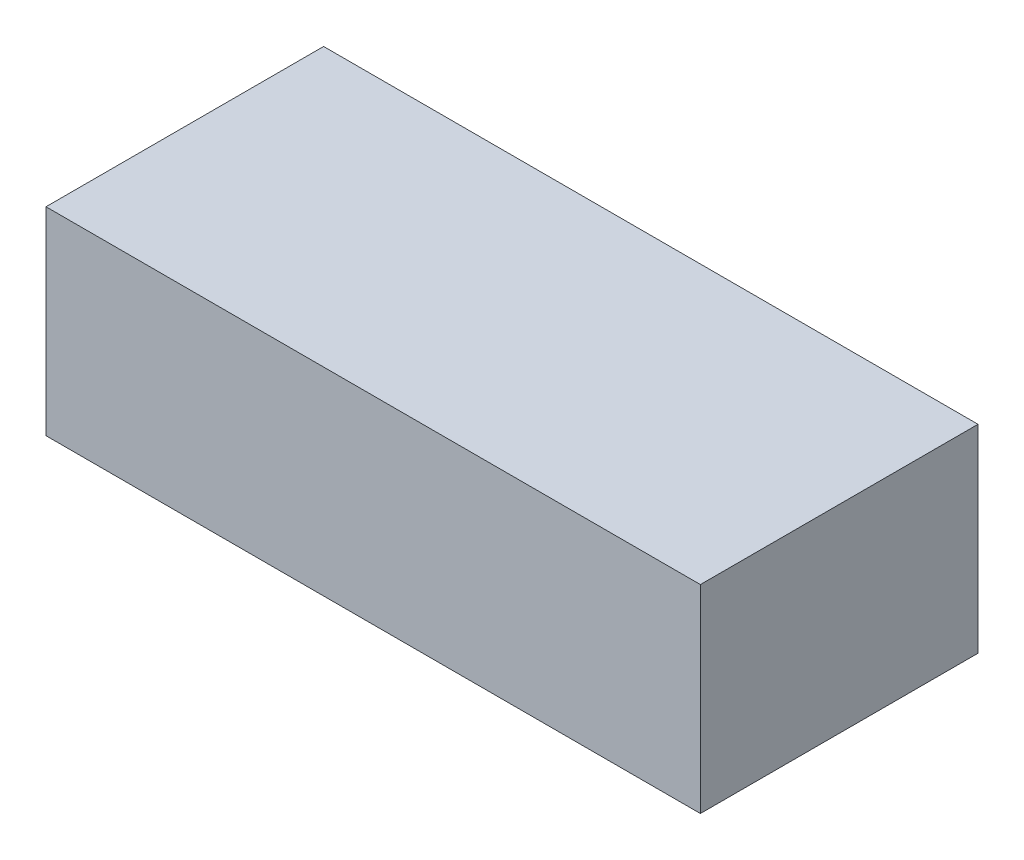
ISO-10303-21;
HEADER;
FILE_DESCRIPTION(('STEP AP214'),'2;1');
FILE_NAME('part.step','',(''),(''),'','','');
FILE_SCHEMA(('AUTOMOTIVE_DESIGN { 1 0 10303 214 1 1 1 1 }'));
ENDSEC;
DATA;
#1=APPLICATION_CONTEXT('core data for automotive mechanical design processes');
#2=APPLICATION_PROTOCOL_DEFINITION('international standard','automotive_design',2000,#1);
#3=PRODUCT_CONTEXT('',#1,'mechanical');
#4=PRODUCT('Part','Part','',(#3));
#5=PRODUCT_RELATED_PRODUCT_CATEGORY('part','',(#4));
#6=PRODUCT_DEFINITION_FORMATION('','',#4);
#7=PRODUCT_DEFINITION_CONTEXT('part definition',#1,'design');
#8=PRODUCT_DEFINITION('design','',#6,#7);
#9=PRODUCT_DEFINITION_SHAPE('','',#8);
#10=(LENGTH_UNIT() NAMED_UNIT(*) SI_UNIT(.MILLI.,.METRE.));
#11=(NAMED_UNIT(*) PLANE_ANGLE_UNIT() SI_UNIT($,.RADIAN.));
#12=(NAMED_UNIT(*) SI_UNIT($,.STERADIAN.) SOLID_ANGLE_UNIT());
#13=UNCERTAINTY_MEASURE_WITH_UNIT(LENGTH_MEASURE(1.E-05),#10,'distance_accuracy_value','');
#14=(GEOMETRIC_REPRESENTATION_CONTEXT(3) GLOBAL_UNCERTAINTY_ASSIGNED_CONTEXT((#13)) GLOBAL_UNIT_ASSIGNED_CONTEXT((#10,
#11,#12)) REPRESENTATION_CONTEXT('',''));
#15=CARTESIAN_POINT('',(0.,0.,0.));
#16=DIRECTION('',(0.,0.,1.));
#17=DIRECTION('',(1.,0.,0.));
#18=AXIS2_PLACEMENT_3D('',#15,#16,#17);
#19=CARTESIAN_POINT('',(0.,0.,0.70000114));
#20=DIRECTION('',(0.,0.,1.));
#21=DIRECTION('',(1.,0.,0.));
#22=AXIS2_PLACEMENT_3D('',#19,#20,#21);
#23=PLANE('',#22);
#24=DIRECTION('',(-1.,0.,0.));
#25=VECTOR('',#24,1.);
#26=CARTESIAN_POINT('',(0.82499962,0.2499995,0.70000114));
#27=LINE('',#26,#25);
#28=CARTESIAN_POINT('',(0.82499962,0.2499995,0.70000114));
#29=VERTEX_POINT('',#28);
#30=CARTESIAN_POINT('',(-0.82499962,0.2499995,0.70000114));
#31=VERTEX_POINT('',#30);
#32=EDGE_CURVE('E83',#29,#31,#27,.T.);
#33=ORIENTED_EDGE('',*,*,#32,.T.);
#34=DIRECTION('',(0.,-1.,0.));
#35=VECTOR('',#34,1.);
#36=CARTESIAN_POINT('',(-0.82499962,0.2499995,0.70000114));
#37=LINE('',#36,#35);
#38=CARTESIAN_POINT('',(-0.82499962,-0.2499995,0.70000114));
#39=VERTEX_POINT('',#38);
#40=EDGE_CURVE('E70',#31,#39,#37,.T.);
#41=ORIENTED_EDGE('',*,*,#40,.T.);
#42=DIRECTION('',(1.,0.,0.));
#43=VECTOR('',#42,1.);
#44=CARTESIAN_POINT('',(-0.82499962,-0.2499995,0.70000114));
#45=LINE('',#44,#43);
#46=CARTESIAN_POINT('',(0.82499962,-0.2499995,0.70000114));
#47=VERTEX_POINT('',#46);
#48=EDGE_CURVE('E106',#39,#47,#45,.T.);
#49=ORIENTED_EDGE('',*,*,#48,.T.);
#50=DIRECTION('',(0.,1.,0.));
#51=VECTOR('',#50,1.);
#52=CARTESIAN_POINT('',(0.82499962,-0.2499995,0.70000114));
#53=LINE('',#52,#51);
#54=EDGE_CURVE('E11',#47,#29,#53,.T.);
#55=ORIENTED_EDGE('',*,*,#54,.T.);
#56=EDGE_LOOP('',(#33,#41,#49,#55));
#57=FACE_BOUND('',#56,.T.);
#58=ADVANCED_FACE('F16',(#57),#23,.T.);
#59=CARTESIAN_POINT('',(0.,0.,0.));
#60=DIRECTION('',(0.,0.,1.));
#61=DIRECTION('',(1.,0.,0.));
#62=AXIS2_PLACEMENT_3D('',#59,#60,#61);
#63=PLANE('',#62);
#64=DIRECTION('',(0.,1.,0.));
#65=VECTOR('',#64,1.);
#66=CARTESIAN_POINT('',(0.82499962,-0.2499995,0.));
#67=LINE('',#66,#65);
#68=CARTESIAN_POINT('',(0.82499962,-0.2499995,0.));
#69=VERTEX_POINT('',#68);
#70=CARTESIAN_POINT('',(0.82499962,0.2499995,0.));
#71=VERTEX_POINT('',#70);
#72=EDGE_CURVE('E25',#69,#71,#67,.T.);
#73=ORIENTED_EDGE('',*,*,#72,.F.);
#74=DIRECTION('',(1.,0.,0.));
#75=VECTOR('',#74,1.);
#76=CARTESIAN_POINT('',(-0.82499962,-0.2499995,0.));
#77=LINE('',#76,#75);
#78=CARTESIAN_POINT('',(-0.82499962,-0.2499995,0.));
#79=VERTEX_POINT('',#78);
#80=EDGE_CURVE('E80',#79,#69,#77,.T.);
#81=ORIENTED_EDGE('',*,*,#80,.F.);
#82=DIRECTION('',(0.,-1.,0.));
#83=VECTOR('',#82,1.);
#84=CARTESIAN_POINT('',(-0.82499962,0.2499995,0.));
#85=LINE('',#84,#83);
#86=CARTESIAN_POINT('',(-0.82499962,0.2499995,0.));
#87=VERTEX_POINT('',#86);
#88=EDGE_CURVE('E99',#87,#79,#85,.T.);
#89=ORIENTED_EDGE('',*,*,#88,.F.);
#90=DIRECTION('',(-1.,0.,0.));
#91=VECTOR('',#90,1.);
#92=CARTESIAN_POINT('',(0.82499962,0.2499995,0.));
#93=LINE('',#92,#91);
#94=EDGE_CURVE('E90',#71,#87,#93,.T.);
#95=ORIENTED_EDGE('',*,*,#94,.F.);
#96=EDGE_LOOP('',(#73,#81,#89,#95));
#97=FACE_BOUND('',#96,.T.);
#98=ADVANCED_FACE('F119',(#97),#63,.F.);
#99=CARTESIAN_POINT('',(0.82499962,-0.2499995,0.));
#100=DIRECTION('',(-1.,0.,0.));
#101=DIRECTION('',(0.,0.,1.));
#102=AXIS2_PLACEMENT_3D('',#99,#100,#101);
#103=PLANE('',#102);
#104=ORIENTED_EDGE('',*,*,#72,.T.);
#105=DIRECTION('',(0.,0.,1.));
#106=VECTOR('',#105,1.);
#107=CARTESIAN_POINT('',(0.82499962,0.2499995,0.));
#108=LINE('',#107,#106);
#109=EDGE_CURVE('E87',#71,#29,#108,.T.);
#110=ORIENTED_EDGE('',*,*,#109,.T.);
#111=ORIENTED_EDGE('',*,*,#54,.F.);
#112=DIRECTION('',(0.,0.,1.));
#113=VECTOR('',#112,1.);
#114=CARTESIAN_POINT('',(0.82499962,-0.2499995,0.));
#115=LINE('',#114,#113);
#116=EDGE_CURVE('E102',#69,#47,#115,.T.);
#117=ORIENTED_EDGE('',*,*,#116,.F.);
#118=EDGE_LOOP('',(#104,#110,#111,#117));
#119=FACE_BOUND('',#118,.T.);
#120=ADVANCED_FACE('F118',(#119),#103,.F.);
#121=CARTESIAN_POINT('',(-0.82499962,-0.2499995,0.));
#122=DIRECTION('',(0.,1.,0.));
#123=DIRECTION('',(1.,0.,0.));
#124=AXIS2_PLACEMENT_3D('',#121,#122,#123);
#125=PLANE('',#124);
#126=ORIENTED_EDGE('',*,*,#80,.T.);
#127=ORIENTED_EDGE('',*,*,#116,.T.);
#128=ORIENTED_EDGE('',*,*,#48,.F.);
#129=DIRECTION('',(0.,0.,1.));
#130=VECTOR('',#129,1.);
#131=CARTESIAN_POINT('',(-0.82499962,-0.2499995,0.));
#132=LINE('',#131,#130);
#133=EDGE_CURVE('E19',#79,#39,#132,.T.);
#134=ORIENTED_EDGE('',*,*,#133,.F.);
#135=EDGE_LOOP('',(#126,#127,#128,#134));
#136=FACE_BOUND('',#135,.T.);
#137=ADVANCED_FACE('F117',(#136),#125,.F.);
#138=CARTESIAN_POINT('',(-0.82499962,0.2499995,0.));
#139=DIRECTION('',(1.,0.,0.));
#140=DIRECTION('',(0.,1.,0.));
#141=AXIS2_PLACEMENT_3D('',#138,#139,#140);
#142=PLANE('',#141);
#143=ORIENTED_EDGE('',*,*,#88,.T.);
#144=ORIENTED_EDGE('',*,*,#133,.T.);
#145=ORIENTED_EDGE('',*,*,#40,.F.);
#146=DIRECTION('',(0.,0.,1.));
#147=VECTOR('',#146,1.);
#148=CARTESIAN_POINT('',(-0.82499962,0.2499995,0.));
#149=LINE('',#148,#147);
#150=EDGE_CURVE('E75',#87,#31,#149,.T.);
#151=ORIENTED_EDGE('',*,*,#150,.F.);
#152=EDGE_LOOP('',(#143,#144,#145,#151));
#153=FACE_BOUND('',#152,.T.);
#154=ADVANCED_FACE('F73',(#153),#142,.F.);
#155=CARTESIAN_POINT('',(0.82499962,0.2499995,0.));
#156=DIRECTION('',(0.,-1.,0.));
#157=DIRECTION('',(0.,0.,-1.));
#158=AXIS2_PLACEMENT_3D('',#155,#156,#157);
#159=PLANE('',#158);
#160=ORIENTED_EDGE('',*,*,#94,.T.);
#161=ORIENTED_EDGE('',*,*,#150,.T.);
#162=ORIENTED_EDGE('',*,*,#32,.F.);
#163=ORIENTED_EDGE('',*,*,#109,.F.);
#164=EDGE_LOOP('',(#160,#161,#162,#163));
#165=FACE_BOUND('',#164,.T.);
#166=ADVANCED_FACE('F89',(#165),#159,.F.);
#167=CLOSED_SHELL('',(#58,#98,#120,#137,#154,#166));
#168=MANIFOLD_SOLID_BREP('B1',#167);
#169=ADVANCED_BREP_SHAPE_REPRESENTATION('',(#18,#168),#14);
#170=SHAPE_DEFINITION_REPRESENTATION(#9,#169);
ENDSEC;
END-ISO-10303-21;
